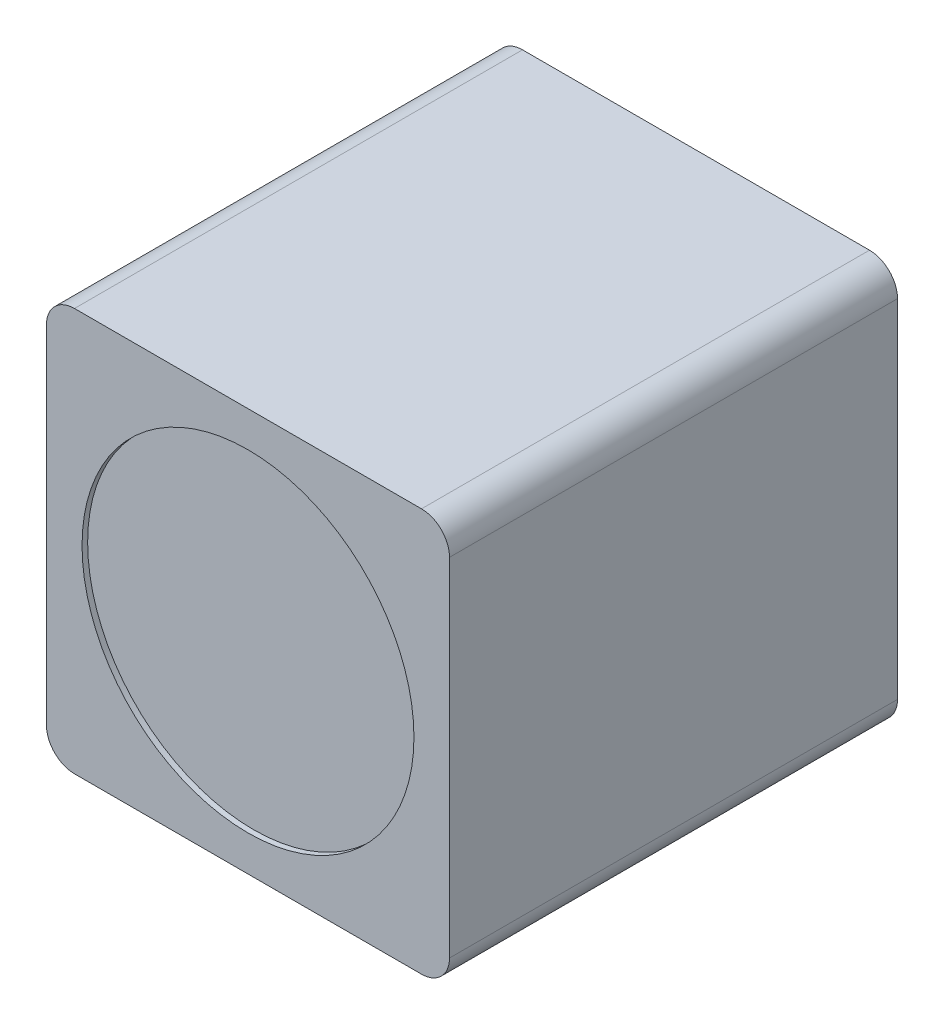
ISO-10303-21;
HEADER;
FILE_DESCRIPTION(('STEP AP214'),'2;1');
FILE_NAME('part.step','',(''),(''),'','','');
FILE_SCHEMA(('AUTOMOTIVE_DESIGN { 1 0 10303 214 1 1 1 1 }'));
ENDSEC;
DATA;
#1=APPLICATION_CONTEXT('core data for automotive mechanical design processes');
#2=APPLICATION_PROTOCOL_DEFINITION('international standard','automotive_design',2000,#1);
#3=PRODUCT_CONTEXT('',#1,'mechanical');
#4=PRODUCT('Part','Part','',(#3));
#5=PRODUCT_RELATED_PRODUCT_CATEGORY('part','',(#4));
#6=PRODUCT_DEFINITION_FORMATION('','',#4);
#7=PRODUCT_DEFINITION_CONTEXT('part definition',#1,'design');
#8=PRODUCT_DEFINITION('design','',#6,#7);
#9=PRODUCT_DEFINITION_SHAPE('','',#8);
#10=(LENGTH_UNIT() NAMED_UNIT(*) SI_UNIT(.MILLI.,.METRE.));
#11=(NAMED_UNIT(*) PLANE_ANGLE_UNIT() SI_UNIT($,.RADIAN.));
#12=(NAMED_UNIT(*) SI_UNIT($,.STERADIAN.) SOLID_ANGLE_UNIT());
#13=UNCERTAINTY_MEASURE_WITH_UNIT(LENGTH_MEASURE(1.E-05),#10,'distance_accuracy_value','');
#14=(GEOMETRIC_REPRESENTATION_CONTEXT(3) GLOBAL_UNCERTAINTY_ASSIGNED_CONTEXT((#13)) GLOBAL_UNIT_ASSIGNED_CONTEXT((#10,
#11,#12)) REPRESENTATION_CONTEXT('',''));
#15=CARTESIAN_POINT('',(0.,0.,0.));
#16=DIRECTION('',(0.,0.,1.));
#17=DIRECTION('',(1.,0.,0.));
#18=AXIS2_PLACEMENT_3D('',#15,#16,#17);
#19=CARTESIAN_POINT('',(-159.165168356227,37.7056568525327,16.));
#20=DIRECTION('',(-1.,0.,0.));
#21=DIRECTION('',(0.,0.,1.));
#22=AXIS2_PLACEMENT_3D('',#19,#20,#21);
#23=PLANE('',#22);
#24=DIRECTION('',(0.,1.,0.));
#25=VECTOR('',#24,1.);
#26=CARTESIAN_POINT('',(-159.165168356227,37.7056568525327,0.));
#27=LINE('',#26,#25);
#28=CARTESIAN_POINT('',(-159.165168356227,38.7056568525327,0.));
#29=VERTEX_POINT('',#28);
#30=CARTESIAN_POINT('',(-159.165168356227,51.098990185866,0.));
#31=VERTEX_POINT('',#30);
#32=EDGE_CURVE('E128',#29,#31,#27,.T.);
#33=ORIENTED_EDGE('',*,*,#32,.T.);
#34=DIRECTION('',(0.,0.,-1.));
#35=VECTOR('',#34,1.);
#36=CARTESIAN_POINT('',(-159.165168356227,51.098990185866,16.));
#37=LINE('',#36,#35);
#38=CARTESIAN_POINT('',(-159.165168356227,51.098990185866,16.));
#39=VERTEX_POINT('',#38);
#40=EDGE_CURVE('E151',#31,#39,#37,.F.);
#41=ORIENTED_EDGE('',*,*,#40,.T.);
#42=DIRECTION('',(0.,1.,0.));
#43=VECTOR('',#42,1.);
#44=CARTESIAN_POINT('',(-159.165168356227,37.7056568525327,16.));
#45=LINE('',#44,#43);
#46=CARTESIAN_POINT('',(-159.165168356227,38.7056568525327,16.));
#47=VERTEX_POINT('',#46);
#48=EDGE_CURVE('E126',#47,#39,#45,.T.);
#49=ORIENTED_EDGE('',*,*,#48,.F.);
#50=DIRECTION('',(0.,0.,-1.));
#51=VECTOR('',#50,1.);
#52=CARTESIAN_POINT('',(-159.165168356227,38.7056568525327,16.));
#53=LINE('',#52,#51);
#54=EDGE_CURVE('E148',#47,#29,#53,.T.);
#55=ORIENTED_EDGE('',*,*,#54,.T.);
#56=EDGE_LOOP('',(#33,#41,#49,#55));
#57=FACE_BOUND('',#56,.T.);
#58=ADVANCED_FACE('F33',(#57),#23,.F.);
#59=CARTESIAN_POINT('',(-173.558501689561,52.098990185866,16.));
#60=DIRECTION('',(0.,-1.,0.));
#61=DIRECTION('',(0.,0.,-1.));
#62=AXIS2_PLACEMENT_3D('',#59,#60,#61);
#63=PLANE('',#62);
#64=DIRECTION('',(-1.,0.,0.));
#65=VECTOR('',#64,1.);
#66=CARTESIAN_POINT('',(-173.558501689561,52.098990185866,0.));
#67=LINE('',#66,#65);
#68=CARTESIAN_POINT('',(-160.165168356227,52.098990185866,0.));
#69=VERTEX_POINT('',#68);
#70=CARTESIAN_POINT('',(-172.558501689561,52.098990185866,0.));
#71=VERTEX_POINT('',#70);
#72=EDGE_CURVE('E124',#69,#71,#67,.T.);
#73=ORIENTED_EDGE('',*,*,#72,.T.);
#74=DIRECTION('',(0.,0.,-1.));
#75=VECTOR('',#74,1.);
#76=CARTESIAN_POINT('',(-172.558501689561,52.098990185866,16.));
#77=LINE('',#76,#75);
#78=CARTESIAN_POINT('',(-172.558501689561,52.098990185866,16.));
#79=VERTEX_POINT('',#78);
#80=EDGE_CURVE('E103',#71,#79,#77,.F.);
#81=ORIENTED_EDGE('',*,*,#80,.T.);
#82=DIRECTION('',(-1.,0.,0.));
#83=VECTOR('',#82,1.);
#84=CARTESIAN_POINT('',(-173.558501689561,52.098990185866,16.));
#85=LINE('',#84,#83);
#86=CARTESIAN_POINT('',(-160.165168356227,52.098990185866,16.));
#87=VERTEX_POINT('',#86);
#88=EDGE_CURVE('E167',#87,#79,#85,.T.);
#89=ORIENTED_EDGE('',*,*,#88,.F.);
#90=DIRECTION('',(0.,0.,-1.));
#91=VECTOR('',#90,1.);
#92=CARTESIAN_POINT('',(-160.165168356227,52.098990185866,16.));
#93=LINE('',#92,#91);
#94=EDGE_CURVE('E108',#87,#69,#93,.T.);
#95=ORIENTED_EDGE('',*,*,#94,.T.);
#96=EDGE_LOOP('',(#73,#81,#89,#95));
#97=FACE_BOUND('',#96,.T.);
#98=ADVANCED_FACE('F191',(#97),#63,.F.);
#99=CARTESIAN_POINT('',(-173.558501689561,37.7056568525327,16.));
#100=DIRECTION('',(1.,0.,0.));
#101=DIRECTION('',(0.,1.,0.));
#102=AXIS2_PLACEMENT_3D('',#99,#100,#101);
#103=PLANE('',#102);
#104=DIRECTION('',(0.,-1.,0.));
#105=VECTOR('',#104,1.);
#106=CARTESIAN_POINT('',(-173.558501689561,37.7056568525327,16.));
#107=LINE('',#106,#105);
#108=CARTESIAN_POINT('',(-173.558501689561,51.098990185866,16.));
#109=VERTEX_POINT('',#108);
#110=CARTESIAN_POINT('',(-173.558501689561,38.7056568525327,16.));
#111=VERTEX_POINT('',#110);
#112=EDGE_CURVE('E117',#109,#111,#107,.T.);
#113=ORIENTED_EDGE('',*,*,#112,.F.);
#114=DIRECTION('',(0.,0.,-1.));
#115=VECTOR('',#114,1.);
#116=CARTESIAN_POINT('',(-173.558501689561,51.098990185866,16.));
#117=LINE('',#116,#115);
#118=CARTESIAN_POINT('',(-173.558501689561,51.098990185866,0.));
#119=VERTEX_POINT('',#118);
#120=EDGE_CURVE('E102',#109,#119,#117,.T.);
#121=ORIENTED_EDGE('',*,*,#120,.T.);
#122=DIRECTION('',(0.,-1.,0.));
#123=VECTOR('',#122,1.);
#124=CARTESIAN_POINT('',(-173.558501689561,37.7056568525327,0.));
#125=LINE('',#124,#123);
#126=CARTESIAN_POINT('',(-173.558501689561,38.7056568525327,0.));
#127=VERTEX_POINT('',#126);
#128=EDGE_CURVE('E115',#119,#127,#125,.T.);
#129=ORIENTED_EDGE('',*,*,#128,.T.);
#130=DIRECTION('',(0.,0.,-1.));
#131=VECTOR('',#130,1.);
#132=CARTESIAN_POINT('',(-173.558501689561,38.7056568525327,16.));
#133=LINE('',#132,#131);
#134=EDGE_CURVE('E119',#127,#111,#133,.F.);
#135=ORIENTED_EDGE('',*,*,#134,.T.);
#136=EDGE_LOOP('',(#113,#121,#129,#135));
#137=FACE_BOUND('',#136,.T.);
#138=ADVANCED_FACE('F114',(#137),#103,.F.);
#139=CARTESIAN_POINT('',(-173.558501689561,37.7056568525327,16.));
#140=DIRECTION('',(0.,1.,0.));
#141=DIRECTION('',(0.,0.,1.));
#142=AXIS2_PLACEMENT_3D('',#139,#140,#141);
#143=PLANE('',#142);
#144=DIRECTION('',(1.,0.,0.));
#145=VECTOR('',#144,1.);
#146=CARTESIAN_POINT('',(-173.558501689561,37.7056568525327,0.));
#147=LINE('',#146,#145);
#148=CARTESIAN_POINT('',(-172.558501689561,37.7056568525327,0.));
#149=VERTEX_POINT('',#148);
#150=CARTESIAN_POINT('',(-160.165168356227,37.7056568525327,0.));
#151=VERTEX_POINT('',#150);
#152=EDGE_CURVE('E123',#149,#151,#147,.T.);
#153=ORIENTED_EDGE('',*,*,#152,.T.);
#154=DIRECTION('',(0.,0.,-1.));
#155=VECTOR('',#154,1.);
#156=CARTESIAN_POINT('',(-160.165168356227,37.7056568525327,16.));
#157=LINE('',#156,#155);
#158=CARTESIAN_POINT('',(-160.165168356227,37.7056568525327,16.));
#159=VERTEX_POINT('',#158);
#160=EDGE_CURVE('E11',#151,#159,#157,.F.);
#161=ORIENTED_EDGE('',*,*,#160,.T.);
#162=DIRECTION('',(1.,0.,0.));
#163=VECTOR('',#162,1.);
#164=CARTESIAN_POINT('',(-173.558501689561,37.7056568525327,16.));
#165=LINE('',#164,#163);
#166=CARTESIAN_POINT('',(-172.558501689561,37.7056568525327,16.));
#167=VERTEX_POINT('',#166);
#168=EDGE_CURVE('E132',#167,#159,#165,.T.);
#169=ORIENTED_EDGE('',*,*,#168,.F.);
#170=DIRECTION('',(0.,0.,-1.));
#171=VECTOR('',#170,1.);
#172=CARTESIAN_POINT('',(-172.558501689561,37.7056568525327,16.));
#173=LINE('',#172,#171);
#174=EDGE_CURVE('E41',#167,#149,#173,.T.);
#175=ORIENTED_EDGE('',*,*,#174,.T.);
#176=EDGE_LOOP('',(#153,#161,#169,#175));
#177=FACE_BOUND('',#176,.T.);
#178=ADVANCED_FACE('F154',(#177),#143,.F.);
#179=CARTESIAN_POINT('',(0.,0.,16.));
#180=DIRECTION('',(0.,0.,-1.));
#181=DIRECTION('',(-1.,0.,0.));
#182=AXIS2_PLACEMENT_3D('',#179,#180,#181);
#183=PLANE('',#182);
#184=CARTESIAN_POINT('',(-166.361835022894,44.9023235191993,16.));
#185=DIRECTION('',(0.,0.,1.));
#186=DIRECTION('',(1.,0.,0.));
#187=AXIS2_PLACEMENT_3D('',#184,#185,#186);
#188=CIRCLE('',#187,5.92666666666668);
#189=CARTESIAN_POINT('',(-160.435168356227,44.9023235191993,16.));
#190=VERTEX_POINT('',#189);
#191=EDGE_CURVE('E172',#190,#190,#188,.T.);
#192=ORIENTED_EDGE('',*,*,#191,.F.);
#193=EDGE_LOOP('',(#192));
#194=FACE_BOUND('',#193,.T.);
#195=ORIENTED_EDGE('',*,*,#88,.T.);
#196=CARTESIAN_POINT('',(-172.558501689561,51.098990185866,16.));
#197=DIRECTION('',(0.,0.,-1.));
#198=DIRECTION('',(-1.,0.,0.));
#199=AXIS2_PLACEMENT_3D('',#196,#197,#198);
#200=CIRCLE('',#199,1.);
#201=EDGE_CURVE('E146',#79,#109,#200,.F.);
#202=ORIENTED_EDGE('',*,*,#201,.T.);
#203=ORIENTED_EDGE('',*,*,#112,.T.);
#204=CARTESIAN_POINT('',(-172.558501689561,38.7056568525327,16.));
#205=DIRECTION('',(0.,0.,-1.));
#206=DIRECTION('',(-1.,0.,0.));
#207=AXIS2_PLACEMENT_3D('',#204,#205,#206);
#208=CIRCLE('',#207,1.);
#209=EDGE_CURVE('E53',#111,#167,#208,.F.);
#210=ORIENTED_EDGE('',*,*,#209,.T.);
#211=ORIENTED_EDGE('',*,*,#168,.T.);
#212=CARTESIAN_POINT('',(-160.165168356227,38.7056568525327,16.));
#213=DIRECTION('',(0.,0.,-1.));
#214=DIRECTION('',(-1.,0.,0.));
#215=AXIS2_PLACEMENT_3D('',#212,#213,#214);
#216=CIRCLE('',#215,1.);
#217=EDGE_CURVE('E142',#159,#47,#216,.F.);
#218=ORIENTED_EDGE('',*,*,#217,.T.);
#219=ORIENTED_EDGE('',*,*,#48,.T.);
#220=CARTESIAN_POINT('',(-160.165168356227,51.098990185866,16.));
#221=DIRECTION('',(0.,0.,-1.));
#222=DIRECTION('',(-1.,0.,0.));
#223=AXIS2_PLACEMENT_3D('',#220,#221,#222);
#224=CIRCLE('',#223,1.);
#225=EDGE_CURVE('E144',#39,#87,#224,.F.);
#226=ORIENTED_EDGE('',*,*,#225,.T.);
#227=EDGE_LOOP('',(#195,#202,#203,#210,#211,#218,#219,#226));
#228=FACE_BOUND('',#227,.T.);
#229=ADVANCED_FACE('F185',(#194,#228),#183,.F.);
#230=CARTESIAN_POINT('',(0.,0.,0.));
#231=DIRECTION('',(0.,0.,-1.));
#232=DIRECTION('',(-1.,0.,0.));
#233=AXIS2_PLACEMENT_3D('',#230,#231,#232);
#234=PLANE('',#233);
#235=ORIENTED_EDGE('',*,*,#128,.F.);
#236=CARTESIAN_POINT('',(-172.558501689561,51.098990185866,0.));
#237=DIRECTION('',(0.,0.,-1.));
#238=DIRECTION('',(-1.,0.,0.));
#239=AXIS2_PLACEMENT_3D('',#236,#237,#238);
#240=CIRCLE('',#239,1.);
#241=EDGE_CURVE('E98',#119,#71,#240,.T.);
#242=ORIENTED_EDGE('',*,*,#241,.T.);
#243=ORIENTED_EDGE('',*,*,#72,.F.);
#244=CARTESIAN_POINT('',(-160.165168356227,51.098990185866,0.));
#245=DIRECTION('',(0.,0.,-1.));
#246=DIRECTION('',(-1.,0.,0.));
#247=AXIS2_PLACEMENT_3D('',#244,#245,#246);
#248=CIRCLE('',#247,1.);
#249=EDGE_CURVE('E109',#69,#31,#248,.T.);
#250=ORIENTED_EDGE('',*,*,#249,.T.);
#251=ORIENTED_EDGE('',*,*,#32,.F.);
#252=CARTESIAN_POINT('',(-160.165168356227,38.7056568525327,0.));
#253=DIRECTION('',(0.,0.,-1.));
#254=DIRECTION('',(-1.,0.,0.));
#255=AXIS2_PLACEMENT_3D('',#252,#253,#254);
#256=CIRCLE('',#255,1.);
#257=EDGE_CURVE('E135',#29,#151,#256,.T.);
#258=ORIENTED_EDGE('',*,*,#257,.T.);
#259=ORIENTED_EDGE('',*,*,#152,.F.);
#260=CARTESIAN_POINT('',(-172.558501689561,38.7056568525327,0.));
#261=DIRECTION('',(0.,0.,-1.));
#262=DIRECTION('',(-1.,0.,0.));
#263=AXIS2_PLACEMENT_3D('',#260,#261,#262);
#264=CIRCLE('',#263,1.);
#265=EDGE_CURVE('E118',#149,#127,#264,.T.);
#266=ORIENTED_EDGE('',*,*,#265,.T.);
#267=EDGE_LOOP('',(#235,#242,#243,#250,#251,#258,#259,#266));
#268=FACE_BOUND('',#267,.T.);
#269=ADVANCED_FACE('F121',(#268),#234,.T.);
#270=CARTESIAN_POINT('',(-172.558501689561,51.098990185866,16.));
#271=DIRECTION('',(0.,0.,-1.));
#272=DIRECTION('',(-1.,0.,0.));
#273=AXIS2_PLACEMENT_3D('',#270,#271,#272);
#274=CYLINDRICAL_SURFACE('',#273,1.);
#275=ORIENTED_EDGE('',*,*,#201,.F.);
#276=ORIENTED_EDGE('',*,*,#80,.F.);
#277=ORIENTED_EDGE('',*,*,#241,.F.);
#278=ORIENTED_EDGE('',*,*,#120,.F.);
#279=EDGE_LOOP('',(#275,#276,#277,#278));
#280=FACE_BOUND('',#279,.T.);
#281=ADVANCED_FACE('F101',(#280),#274,.T.);
#282=CARTESIAN_POINT('',(-160.165168356227,51.098990185866,16.));
#283=DIRECTION('',(0.,0.,-1.));
#284=DIRECTION('',(-1.,0.,0.));
#285=AXIS2_PLACEMENT_3D('',#282,#283,#284);
#286=CYLINDRICAL_SURFACE('',#285,1.);
#287=ORIENTED_EDGE('',*,*,#225,.F.);
#288=ORIENTED_EDGE('',*,*,#40,.F.);
#289=ORIENTED_EDGE('',*,*,#249,.F.);
#290=ORIENTED_EDGE('',*,*,#94,.F.);
#291=EDGE_LOOP('',(#287,#288,#289,#290));
#292=FACE_BOUND('',#291,.T.);
#293=ADVANCED_FACE('F193',(#292),#286,.T.);
#294=CARTESIAN_POINT('',(-160.165168356227,38.7056568525327,16.));
#295=DIRECTION('',(0.,0.,-1.));
#296=DIRECTION('',(-1.,0.,0.));
#297=AXIS2_PLACEMENT_3D('',#294,#295,#296);
#298=CYLINDRICAL_SURFACE('',#297,1.);
#299=ORIENTED_EDGE('',*,*,#217,.F.);
#300=ORIENTED_EDGE('',*,*,#160,.F.);
#301=ORIENTED_EDGE('',*,*,#257,.F.);
#302=ORIENTED_EDGE('',*,*,#54,.F.);
#303=EDGE_LOOP('',(#299,#300,#301,#302));
#304=FACE_BOUND('',#303,.T.);
#305=ADVANCED_FACE('F161',(#304),#298,.T.);
#306=CARTESIAN_POINT('',(-172.558501689561,38.7056568525327,16.));
#307=DIRECTION('',(0.,0.,-1.));
#308=DIRECTION('',(-1.,0.,0.));
#309=AXIS2_PLACEMENT_3D('',#306,#307,#308);
#310=CYLINDRICAL_SURFACE('',#309,1.);
#311=ORIENTED_EDGE('',*,*,#209,.F.);
#312=ORIENTED_EDGE('',*,*,#134,.F.);
#313=ORIENTED_EDGE('',*,*,#265,.F.);
#314=ORIENTED_EDGE('',*,*,#174,.F.);
#315=EDGE_LOOP('',(#311,#312,#313,#314));
#316=FACE_BOUND('',#315,.T.);
#317=ADVANCED_FACE('F35',(#316),#310,.T.);
#318=CARTESIAN_POINT('',(-166.361835022894,44.9023235191993,15.8));
#319=DIRECTION('',(0.,0.,1.));
#320=DIRECTION('',(1.,0.,0.));
#321=AXIS2_PLACEMENT_3D('',#318,#319,#320);
#322=CYLINDRICAL_SURFACE('',#321,5.92666666666668);
#323=CARTESIAN_POINT('',(-166.361835022894,44.9023235191993,15.8));
#324=DIRECTION('',(0.,0.,1.));
#325=DIRECTION('',(1.,0.,0.));
#326=AXIS2_PLACEMENT_3D('',#323,#324,#325);
#327=CIRCLE('',#326,5.92666666666668);
#328=CARTESIAN_POINT('',(-160.435168356227,44.9023235191993,15.8));
#329=VERTEX_POINT('',#328);
#330=EDGE_CURVE('E176',#329,#329,#327,.T.);
#331=ORIENTED_EDGE('',*,*,#330,.F.);
#332=EDGE_LOOP('',(#331));
#333=FACE_BOUND('',#332,.T.);
#334=ORIENTED_EDGE('',*,*,#191,.T.);
#335=EDGE_LOOP('',(#334));
#336=FACE_BOUND('',#335,.T.);
#337=ADVANCED_FACE('F183',(#333,#336),#322,.F.);
#338=CARTESIAN_POINT('',(-166.361835022894,44.9023235191993,15.8));
#339=DIRECTION('',(0.,0.,1.));
#340=DIRECTION('',(1.,0.,0.));
#341=AXIS2_PLACEMENT_3D('',#338,#339,#340);
#342=PLANE('',#341);
#343=ORIENTED_EDGE('',*,*,#330,.T.);
#344=EDGE_LOOP('',(#343));
#345=FACE_BOUND('',#344,.T.);
#346=ADVANCED_FACE('F216',(#345),#342,.T.);
#347=CLOSED_SHELL('',(#58,#98,#138,#178,#229,#269,#281,#293,#305,#317,#337,#346));
#348=MANIFOLD_SOLID_BREP('B2',#347);
#349=ADVANCED_BREP_SHAPE_REPRESENTATION('',(#18,#348),#14);
#350=SHAPE_DEFINITION_REPRESENTATION(#9,#349);
ENDSEC;
END-ISO-10303-21;
